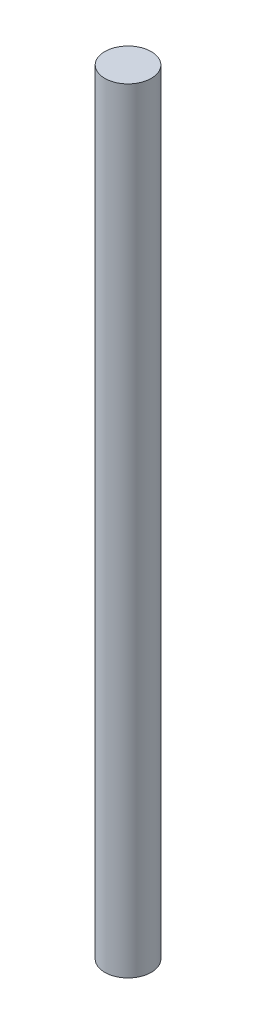
ISO-10303-21;
HEADER;
FILE_DESCRIPTION(('STEP AP214'),'2;1');
FILE_NAME('part.step','',(''),(''),'','','');
FILE_SCHEMA(('AUTOMOTIVE_DESIGN { 1 0 10303 214 1 1 1 1 }'));
ENDSEC;
DATA;
#1=APPLICATION_CONTEXT('core data for automotive mechanical design processes');
#2=APPLICATION_PROTOCOL_DEFINITION('international standard','automotive_design',2000,#1);
#3=PRODUCT_CONTEXT('',#1,'mechanical');
#4=PRODUCT('Part','Part','',(#3));
#5=PRODUCT_RELATED_PRODUCT_CATEGORY('part','',(#4));
#6=PRODUCT_DEFINITION_FORMATION('','',#4);
#7=PRODUCT_DEFINITION_CONTEXT('part definition',#1,'design');
#8=PRODUCT_DEFINITION('design','',#6,#7);
#9=PRODUCT_DEFINITION_SHAPE('','',#8);
#10=(LENGTH_UNIT() NAMED_UNIT(*) SI_UNIT(.MILLI.,.METRE.));
#11=(NAMED_UNIT(*) PLANE_ANGLE_UNIT() SI_UNIT($,.RADIAN.));
#12=(NAMED_UNIT(*) SI_UNIT($,.STERADIAN.) SOLID_ANGLE_UNIT());
#13=UNCERTAINTY_MEASURE_WITH_UNIT(LENGTH_MEASURE(1.E-05),#10,'distance_accuracy_value','');
#14=(GEOMETRIC_REPRESENTATION_CONTEXT(3) GLOBAL_UNCERTAINTY_ASSIGNED_CONTEXT((#13)) GLOBAL_UNIT_ASSIGNED_CONTEXT((#10,
#11,#12)) REPRESENTATION_CONTEXT('',''));
#15=CARTESIAN_POINT('',(0.,0.,0.));
#16=DIRECTION('',(0.,0.,1.));
#17=DIRECTION('',(1.,0.,0.));
#18=AXIS2_PLACEMENT_3D('',#15,#16,#17);
#19=CARTESIAN_POINT('',(0.,0.,0.));
#20=DIRECTION('',(0.,-1.,0.));
#21=DIRECTION('',(0.,0.,-1.));
#22=AXIS2_PLACEMENT_3D('',#19,#20,#21);
#23=PLANE('',#22);
#24=CARTESIAN_POINT('',(0.,0.,0.));
#25=DIRECTION('',(0.,-1.,0.));
#26=DIRECTION('',(0.,0.,-1.));
#27=AXIS2_PLACEMENT_3D('',#24,#25,#26);
#28=CIRCLE('',#27,4.5);
#29=CARTESIAN_POINT('',(0.,0.,-4.5));
#30=VERTEX_POINT('',#29);
#31=EDGE_CURVE('E10',#30,#30,#28,.T.);
#32=ORIENTED_EDGE('',*,*,#31,.T.);
#33=EDGE_LOOP('',(#32));
#34=FACE_BOUND('',#33,.T.);
#35=ADVANCED_FACE('F43',(#34),#23,.T.);
#36=CARTESIAN_POINT('',(0.,0.,0.));
#37=DIRECTION('',(0.,-1.,0.));
#38=DIRECTION('',(0.,0.,-1.));
#39=AXIS2_PLACEMENT_3D('',#36,#37,#38);
#40=CYLINDRICAL_SURFACE('',#39,4.5);
#41=CARTESIAN_POINT('',(0.,150.,0.));
#42=DIRECTION('',(0.,-1.,0.));
#43=DIRECTION('',(0.,0.,-1.));
#44=AXIS2_PLACEMENT_3D('',#41,#42,#43);
#45=CIRCLE('',#44,4.5);
#46=CARTESIAN_POINT('',(0.,150.,-4.5));
#47=VERTEX_POINT('',#46);
#48=EDGE_CURVE('E50',#47,#47,#45,.T.);
#49=ORIENTED_EDGE('',*,*,#48,.T.);
#50=EDGE_LOOP('',(#49));
#51=FACE_BOUND('',#50,.T.);
#52=ORIENTED_EDGE('',*,*,#31,.F.);
#53=EDGE_LOOP('',(#52));
#54=FACE_BOUND('',#53,.T.);
#55=ADVANCED_FACE('F59',(#51,#54),#40,.T.);
#56=CARTESIAN_POINT('',(0.,150.,0.));
#57=DIRECTION('',(0.,1.,0.));
#58=DIRECTION('',(0.,0.,1.));
#59=AXIS2_PLACEMENT_3D('',#56,#57,#58);
#60=PLANE('',#59);
#61=ORIENTED_EDGE('',*,*,#48,.F.);
#62=EDGE_LOOP('',(#61));
#63=FACE_BOUND('',#62,.T.);
#64=ADVANCED_FACE('F62',(#63),#60,.T.);
#65=CLOSED_SHELL('',(#35,#55,#64));
#66=MANIFOLD_SOLID_BREP('B2',#65);
#67=ADVANCED_BREP_SHAPE_REPRESENTATION('',(#18,#66),#14);
#68=SHAPE_DEFINITION_REPRESENTATION(#9,#67);
ENDSEC;
END-ISO-10303-21;
